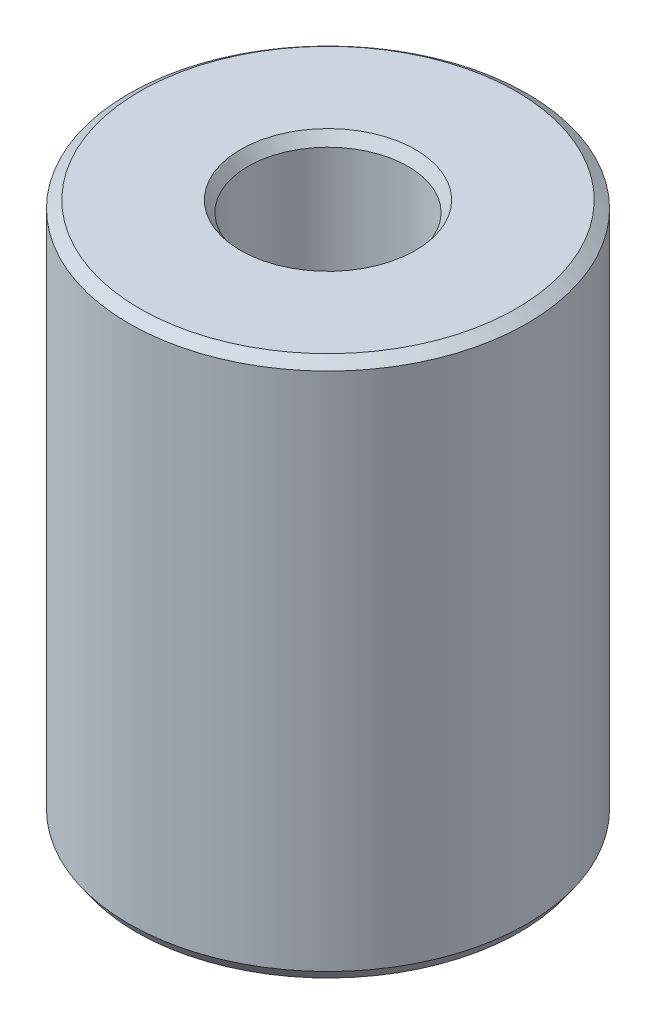
ISO-10303-21;
HEADER;
FILE_DESCRIPTION(('STEP AP214'),'2;1');
FILE_NAME('part.step','',(''),(''),'','','');
FILE_SCHEMA(('AUTOMOTIVE_DESIGN { 1 0 10303 214 1 1 1 1 }'));
ENDSEC;
DATA;
#1=APPLICATION_CONTEXT('core data for automotive mechanical design processes');
#2=APPLICATION_PROTOCOL_DEFINITION('international standard','automotive_design',2000,#1);
#3=PRODUCT_CONTEXT('',#1,'mechanical');
#4=PRODUCT('Part','Part','',(#3));
#5=PRODUCT_RELATED_PRODUCT_CATEGORY('part','',(#4));
#6=PRODUCT_DEFINITION_FORMATION('','',#4);
#7=PRODUCT_DEFINITION_CONTEXT('part definition',#1,'design');
#8=PRODUCT_DEFINITION('design','',#6,#7);
#9=PRODUCT_DEFINITION_SHAPE('','',#8);
#10=(LENGTH_UNIT() NAMED_UNIT(*) SI_UNIT(.MILLI.,.METRE.));
#11=(NAMED_UNIT(*) PLANE_ANGLE_UNIT() SI_UNIT($,.RADIAN.));
#12=(NAMED_UNIT(*) SI_UNIT($,.STERADIAN.) SOLID_ANGLE_UNIT());
#13=UNCERTAINTY_MEASURE_WITH_UNIT(LENGTH_MEASURE(1.E-05),#10,'distance_accuracy_value','');
#14=(GEOMETRIC_REPRESENTATION_CONTEXT(3) GLOBAL_UNCERTAINTY_ASSIGNED_CONTEXT((#13)) GLOBAL_UNIT_ASSIGNED_CONTEXT((#10,
#11,#12)) REPRESENTATION_CONTEXT('',''));
#15=CARTESIAN_POINT('',(0.,0.,0.));
#16=DIRECTION('',(0.,0.,1.));
#17=DIRECTION('',(1.,0.,0.));
#18=AXIS2_PLACEMENT_3D('',#15,#16,#17);
#19=CARTESIAN_POINT('',(0.,67.5928245481363,0.));
#20=DIRECTION('',(0.,-1.,0.));
#21=DIRECTION('',(0.,0.,-1.));
#22=AXIS2_PLACEMENT_3D('',#19,#20,#21);
#23=CYLINDRICAL_SURFACE('',#22,25.);
#24=CARTESIAN_POINT('',(0.,1.36396893406404,0.));
#25=DIRECTION('',(0.,1.,0.));
#26=DIRECTION('',(0.,0.,1.));
#27=AXIS2_PLACEMENT_3D('',#24,#25,#26);
#28=CIRCLE('',#27,25.);
#29=CARTESIAN_POINT('',(0.,1.36396893406404,25.));
#30=VERTEX_POINT('',#29);
#31=EDGE_CURVE('E10',#30,#30,#28,.T.);
#32=ORIENTED_EDGE('',*,*,#31,.T.);
#33=EDGE_LOOP('',(#32));
#34=FACE_BOUND('',#33,.T.);
#35=CARTESIAN_POINT('',(0.,66.6587340052919,0.));
#36=DIRECTION('',(0.,1.,0.));
#37=DIRECTION('',(0.,0.,1.));
#38=AXIS2_PLACEMENT_3D('',#35,#36,#37);
#39=CIRCLE('',#38,25.);
#40=CARTESIAN_POINT('',(0.,66.6587340052919,25.));
#41=VERTEX_POINT('',#40);
#42=EDGE_CURVE('E50',#41,#41,#39,.F.);
#43=ORIENTED_EDGE('',*,*,#42,.T.);
#44=EDGE_LOOP('',(#43));
#45=FACE_BOUND('',#44,.T.);
#46=ADVANCED_FACE('F39',(#34,#45),#23,.T.);
#47=CARTESIAN_POINT('',(0.,67.5928245481363,0.));
#48=DIRECTION('',(0.,1.,0.));
#49=DIRECTION('',(0.,0.,1.));
#50=AXIS2_PLACEMENT_3D('',#47,#48,#49);
#51=PLANE('',#50);
#52=CARTESIAN_POINT('',(0.,67.5928245481363,0.));
#53=DIRECTION('',(0.,1.,0.));
#54=DIRECTION('',(0.,0.,1.));
#55=AXIS2_PLACEMENT_3D('',#52,#53,#54);
#56=CIRCLE('',#55,10.9806974481259);
#57=CARTESIAN_POINT('',(0.,67.5928245481363,10.9806974481259));
#58=VERTEX_POINT('',#57);
#59=EDGE_CURVE('E58',#58,#58,#56,.F.);
#60=ORIENTED_EDGE('',*,*,#59,.T.);
#61=EDGE_LOOP('',(#60));
#62=FACE_BOUND('',#61,.T.);
#63=CARTESIAN_POINT('',(0.,67.5928245481363,0.));
#64=DIRECTION('',(0.,1.,0.));
#65=DIRECTION('',(0.,0.,1.));
#66=AXIS2_PLACEMENT_3D('',#63,#64,#65);
#67=CIRCLE('',#66,23.636031065936);
#68=CARTESIAN_POINT('',(0.,67.5928245481363,23.636031065936));
#69=VERTEX_POINT('',#68);
#70=EDGE_CURVE('E61',#69,#69,#67,.T.);
#71=ORIENTED_EDGE('',*,*,#70,.T.);
#72=EDGE_LOOP('',(#71));
#73=FACE_BOUND('',#72,.T.);
#74=ADVANCED_FACE('F88',(#62,#73),#51,.T.);
#75=CARTESIAN_POINT('',(0.,0.,0.));
#76=DIRECTION('',(0.,1.,0.));
#77=DIRECTION('',(0.,0.,1.));
#78=AXIS2_PLACEMENT_3D('',#75,#76,#77);
#79=PLANE('',#78);
#80=CARTESIAN_POINT('',(0.,0.,0.));
#81=DIRECTION('',(0.,1.,0.));
#82=DIRECTION('',(0.,0.,1.));
#83=AXIS2_PLACEMENT_3D('',#80,#81,#82);
#84=CIRCLE('',#83,11.4105758393454);
#85=CARTESIAN_POINT('',(0.,0.,11.4105758393454));
#86=VERTEX_POINT('',#85);
#87=EDGE_CURVE('E51',#86,#86,#84,.T.);
#88=ORIENTED_EDGE('',*,*,#87,.T.);
#89=EDGE_LOOP('',(#88));
#90=FACE_BOUND('',#89,.T.);
#91=CARTESIAN_POINT('',(0.,0.,0.));
#92=DIRECTION('',(0.,1.,0.));
#93=DIRECTION('',(0.,0.,1.));
#94=AXIS2_PLACEMENT_3D('',#91,#92,#93);
#95=CIRCLE('',#94,24.0659094571555);
#96=CARTESIAN_POINT('',(0.,0.,24.0659094571555));
#97=VERTEX_POINT('',#96);
#98=EDGE_CURVE('E54',#97,#97,#95,.F.);
#99=ORIENTED_EDGE('',*,*,#98,.T.);
#100=EDGE_LOOP('',(#99));
#101=FACE_BOUND('',#100,.T.);
#102=ADVANCED_FACE('F83',(#90,#101),#79,.F.);
#103=CARTESIAN_POINT('',(0.,67.5928245481363,0.));
#104=DIRECTION('',(0.,-1.,0.));
#105=DIRECTION('',(0.,0.,-1.));
#106=AXIS2_PLACEMENT_3D('',#103,#104,#105);
#107=CYLINDRICAL_SURFACE('',#106,10.0466069052814);
#108=CARTESIAN_POINT('',(0.,66.2288556140723,0.));
#109=DIRECTION('',(0.,1.,0.));
#110=DIRECTION('',(0.,0.,1.));
#111=AXIS2_PLACEMENT_3D('',#108,#109,#110);
#112=CIRCLE('',#111,10.0466069052814);
#113=CARTESIAN_POINT('',(0.,66.2288556140723,10.0466069052814));
#114=VERTEX_POINT('',#113);
#115=EDGE_CURVE('E67',#114,#114,#112,.T.);
#116=ORIENTED_EDGE('',*,*,#115,.T.);
#117=EDGE_LOOP('',(#116));
#118=FACE_BOUND('',#117,.T.);
#119=CARTESIAN_POINT('',(0.,0.934090542844462,0.));
#120=DIRECTION('',(0.,1.,0.));
#121=DIRECTION('',(0.,0.,1.));
#122=AXIS2_PLACEMENT_3D('',#119,#120,#121);
#123=CIRCLE('',#122,10.0466069052814);
#124=CARTESIAN_POINT('',(0.,0.934090542844462,10.0466069052814));
#125=VERTEX_POINT('',#124);
#126=EDGE_CURVE('E69',#125,#125,#123,.F.);
#127=ORIENTED_EDGE('',*,*,#126,.T.);
#128=EDGE_LOOP('',(#127));
#129=FACE_BOUND('',#128,.T.);
#130=ADVANCED_FACE('F71',(#118,#129),#107,.F.);
#131=CARTESIAN_POINT('',(0.,66.2288556140723,0.));
#132=DIRECTION('',(0.,1.,0.));
#133=DIRECTION('',(0.,0.,1.));
#134=AXIS2_PLACEMENT_3D('',#131,#132,#133);
#135=CONICAL_SURFACE('',#134,10.0466069052814,0.600473880479322);
#136=ORIENTED_EDGE('',*,*,#59,.F.);
#137=EDGE_LOOP('',(#136));
#138=FACE_BOUND('',#137,.T.);
#139=ORIENTED_EDGE('',*,*,#115,.F.);
#140=EDGE_LOOP('',(#139));
#141=FACE_BOUND('',#140,.T.);
#142=ADVANCED_FACE('F77',(#138,#141),#135,.F.);
#143=CARTESIAN_POINT('',(0.,0.,0.));
#144=DIRECTION('',(0.,-1.,0.));
#145=DIRECTION('',(0.,0.,-1.));
#146=AXIS2_PLACEMENT_3D('',#143,#144,#145);
#147=CONICAL_SURFACE('',#146,11.4105758393454,0.970322446315572);
#148=ORIENTED_EDGE('',*,*,#126,.F.);
#149=EDGE_LOOP('',(#148));
#150=FACE_BOUND('',#149,.T.);
#151=ORIENTED_EDGE('',*,*,#87,.F.);
#152=EDGE_LOOP('',(#151));
#153=FACE_BOUND('',#152,.T.);
#154=ADVANCED_FACE('F73',(#150,#153),#147,.F.);
#155=CARTESIAN_POINT('',(0.,1.36396893406404,0.));
#156=DIRECTION('',(0.,1.,0.));
#157=DIRECTION('',(0.,0.,1.));
#158=AXIS2_PLACEMENT_3D('',#155,#156,#157);
#159=CONICAL_SURFACE('',#158,25.,0.600473880479325);
#160=ORIENTED_EDGE('',*,*,#98,.F.);
#161=EDGE_LOOP('',(#160));
#162=FACE_BOUND('',#161,.T.);
#163=ORIENTED_EDGE('',*,*,#31,.F.);
#164=EDGE_LOOP('',(#163));
#165=FACE_BOUND('',#164,.T.);
#166=ADVANCED_FACE('F76',(#162,#165),#159,.T.);
#167=CARTESIAN_POINT('',(0.,67.5928245481363,0.));
#168=DIRECTION('',(0.,-1.,0.));
#169=DIRECTION('',(0.,0.,-1.));
#170=AXIS2_PLACEMENT_3D('',#167,#168,#169);
#171=CONICAL_SURFACE('',#170,23.636031065936,0.970322446315578);
#172=ORIENTED_EDGE('',*,*,#42,.F.);
#173=EDGE_LOOP('',(#172));
#174=FACE_BOUND('',#173,.T.);
#175=ORIENTED_EDGE('',*,*,#70,.F.);
#176=EDGE_LOOP('',(#175));
#177=FACE_BOUND('',#176,.T.);
#178=ADVANCED_FACE('F45',(#174,#177),#171,.T.);
#179=CLOSED_SHELL('',(#46,#74,#102,#130,#142,#154,#166,#178));
#180=MANIFOLD_SOLID_BREP('B2',#179);
#181=ADVANCED_BREP_SHAPE_REPRESENTATION('',(#18,#180),#14);
#182=SHAPE_DEFINITION_REPRESENTATION(#9,#181);
ENDSEC;
END-ISO-10303-21;
